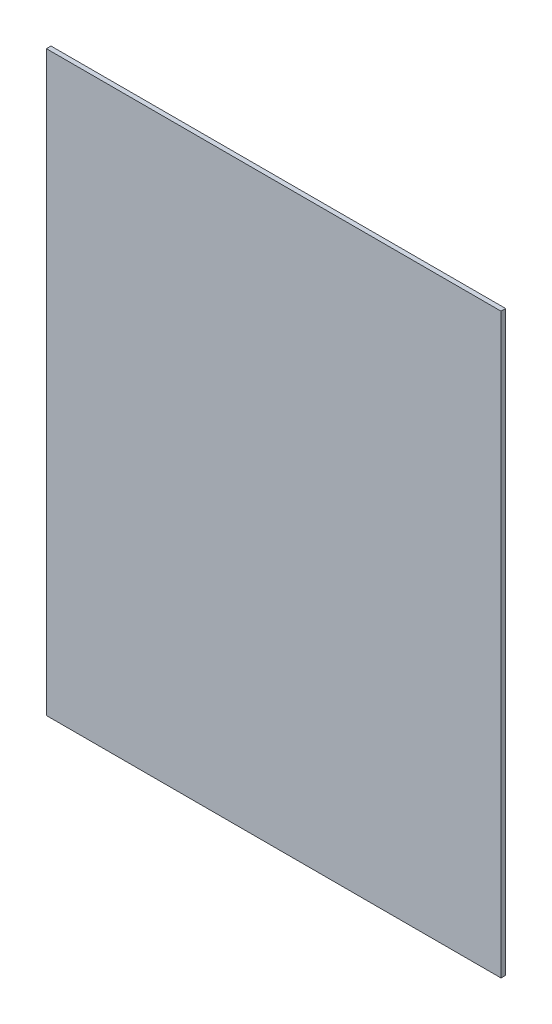
ISO-10303-21;
HEADER;
FILE_DESCRIPTION(('STEP AP214'),'2;1');
FILE_NAME('part.step','',(''),(''),'','','');
FILE_SCHEMA(('AUTOMOTIVE_DESIGN { 1 0 10303 214 1 1 1 1 }'));
ENDSEC;
DATA;
#1=APPLICATION_CONTEXT('core data for automotive mechanical design processes');
#2=APPLICATION_PROTOCOL_DEFINITION('international standard','automotive_design',2000,#1);
#3=PRODUCT_CONTEXT('',#1,'mechanical');
#4=PRODUCT('Part','Part','',(#3));
#5=PRODUCT_RELATED_PRODUCT_CATEGORY('part','',(#4));
#6=PRODUCT_DEFINITION_FORMATION('','',#4);
#7=PRODUCT_DEFINITION_CONTEXT('part definition',#1,'design');
#8=PRODUCT_DEFINITION('design','',#6,#7);
#9=PRODUCT_DEFINITION_SHAPE('','',#8);
#10=(LENGTH_UNIT() NAMED_UNIT(*) SI_UNIT(.MILLI.,.METRE.));
#11=(NAMED_UNIT(*) PLANE_ANGLE_UNIT() SI_UNIT($,.RADIAN.));
#12=(NAMED_UNIT(*) SI_UNIT($,.STERADIAN.) SOLID_ANGLE_UNIT());
#13=UNCERTAINTY_MEASURE_WITH_UNIT(LENGTH_MEASURE(1.E-05),#10,'distance_accuracy_value','');
#14=(GEOMETRIC_REPRESENTATION_CONTEXT(3) GLOBAL_UNCERTAINTY_ASSIGNED_CONTEXT((#13)) GLOBAL_UNIT_ASSIGNED_CONTEXT((#10,
#11,#12)) REPRESENTATION_CONTEXT('',''));
#15=CARTESIAN_POINT('',(0.,0.,0.));
#16=DIRECTION('',(0.,0.,1.));
#17=DIRECTION('',(1.,0.,0.));
#18=AXIS2_PLACEMENT_3D('',#15,#16,#17);
#19=CARTESIAN_POINT('',(36.9999999999999,5.50000000000002,0.75));
#20=DIRECTION('',(0.,1.,0.));
#21=DIRECTION('',(0.,0.,1.));
#22=AXIS2_PLACEMENT_3D('',#19,#20,#21);
#23=PLANE('',#22);
#24=DIRECTION('',(1.,0.,0.));
#25=VECTOR('',#24,1.);
#26=CARTESIAN_POINT('',(36.9999999999999,5.50000000000002,0.));
#27=LINE('',#26,#25);
#28=CARTESIAN_POINT('',(-37.,5.50000000000002,0.));
#29=VERTEX_POINT('',#28);
#30=CARTESIAN_POINT('',(36.9999999999999,5.50000000000002,0.));
#31=VERTEX_POINT('',#30);
#32=EDGE_CURVE('E96',#29,#31,#27,.T.);
#33=ORIENTED_EDGE('',*,*,#32,.T.);
#34=DIRECTION('',(0.,0.,-1.));
#35=VECTOR('',#34,1.);
#36=CARTESIAN_POINT('',(36.9999999999999,5.50000000000002,0.75));
#37=LINE('',#36,#35);
#38=CARTESIAN_POINT('',(36.9999999999999,5.50000000000002,0.75));
#39=VERTEX_POINT('',#38);
#40=EDGE_CURVE('E11',#39,#31,#37,.T.);
#41=ORIENTED_EDGE('',*,*,#40,.F.);
#42=DIRECTION('',(1.,0.,0.));
#43=VECTOR('',#42,1.);
#44=CARTESIAN_POINT('',(36.9999999999999,5.50000000000002,0.75));
#45=LINE('',#44,#43);
#46=CARTESIAN_POINT('',(-37.,5.50000000000002,0.75));
#47=VERTEX_POINT('',#46);
#48=EDGE_CURVE('E84',#47,#39,#45,.T.);
#49=ORIENTED_EDGE('',*,*,#48,.F.);
#50=DIRECTION('',(0.,0.,-1.));
#51=VECTOR('',#50,1.);
#52=CARTESIAN_POINT('',(-37.,5.50000000000002,0.75));
#53=LINE('',#52,#51);
#54=EDGE_CURVE('E92',#47,#29,#53,.T.);
#55=ORIENTED_EDGE('',*,*,#54,.T.);
#56=EDGE_LOOP('',(#33,#41,#49,#55));
#57=FACE_BOUND('',#56,.T.);
#58=ADVANCED_FACE('F33',(#57),#23,.F.);
#59=CARTESIAN_POINT('',(36.9999999999999,99.5,0.75));
#60=DIRECTION('',(-1.,0.,0.));
#61=DIRECTION('',(0.,0.,1.));
#62=AXIS2_PLACEMENT_3D('',#59,#60,#61);
#63=PLANE('',#62);
#64=DIRECTION('',(0.,1.,0.));
#65=VECTOR('',#64,1.);
#66=CARTESIAN_POINT('',(36.9999999999999,99.5,0.));
#67=LINE('',#66,#65);
#68=CARTESIAN_POINT('',(36.9999999999999,99.5,0.));
#69=VERTEX_POINT('',#68);
#70=EDGE_CURVE('E88',#31,#69,#67,.T.);
#71=ORIENTED_EDGE('',*,*,#70,.T.);
#72=DIRECTION('',(0.,0.,-1.));
#73=VECTOR('',#72,1.);
#74=CARTESIAN_POINT('',(36.9999999999999,99.5,0.75));
#75=LINE('',#74,#73);
#76=CARTESIAN_POINT('',(36.9999999999999,99.5,0.75));
#77=VERTEX_POINT('',#76);
#78=EDGE_CURVE('E41',#77,#69,#75,.T.);
#79=ORIENTED_EDGE('',*,*,#78,.F.);
#80=DIRECTION('',(0.,1.,0.));
#81=VECTOR('',#80,1.);
#82=CARTESIAN_POINT('',(36.9999999999999,99.5,0.75));
#83=LINE('',#82,#81);
#84=EDGE_CURVE('E79',#39,#77,#83,.T.);
#85=ORIENTED_EDGE('',*,*,#84,.F.);
#86=ORIENTED_EDGE('',*,*,#40,.T.);
#87=EDGE_LOOP('',(#71,#79,#85,#86));
#88=FACE_BOUND('',#87,.T.);
#89=ADVANCED_FACE('F87',(#88),#63,.F.);
#90=CARTESIAN_POINT('',(-37.,99.5,0.75));
#91=DIRECTION('',(0.,-1.,0.));
#92=DIRECTION('',(0.,0.,-1.));
#93=AXIS2_PLACEMENT_3D('',#90,#91,#92);
#94=PLANE('',#93);
#95=DIRECTION('',(-1.,0.,0.));
#96=VECTOR('',#95,1.);
#97=CARTESIAN_POINT('',(-37.,99.5,0.));
#98=LINE('',#97,#96);
#99=CARTESIAN_POINT('',(-37.,99.5,0.));
#100=VERTEX_POINT('',#99);
#101=EDGE_CURVE('E66',#69,#100,#98,.T.);
#102=ORIENTED_EDGE('',*,*,#101,.T.);
#103=DIRECTION('',(0.,0.,-1.));
#104=VECTOR('',#103,1.);
#105=CARTESIAN_POINT('',(-37.,99.5,0.75));
#106=LINE('',#105,#104);
#107=CARTESIAN_POINT('',(-37.,99.5,0.75));
#108=VERTEX_POINT('',#107);
#109=EDGE_CURVE('E89',#108,#100,#106,.T.);
#110=ORIENTED_EDGE('',*,*,#109,.F.);
#111=DIRECTION('',(-1.,0.,0.));
#112=VECTOR('',#111,1.);
#113=CARTESIAN_POINT('',(-37.,99.5,0.75));
#114=LINE('',#113,#112);
#115=EDGE_CURVE('E82',#77,#108,#114,.T.);
#116=ORIENTED_EDGE('',*,*,#115,.F.);
#117=ORIENTED_EDGE('',*,*,#78,.T.);
#118=EDGE_LOOP('',(#102,#110,#116,#117));
#119=FACE_BOUND('',#118,.T.);
#120=ADVANCED_FACE('F90',(#119),#94,.F.);
#121=CARTESIAN_POINT('',(-37.,5.50000000000002,0.75));
#122=DIRECTION('',(1.,0.,0.));
#123=DIRECTION('',(0.,0.,-1.));
#124=AXIS2_PLACEMENT_3D('',#121,#122,#123);
#125=PLANE('',#124);
#126=DIRECTION('',(0.,-1.,0.));
#127=VECTOR('',#126,1.);
#128=CARTESIAN_POINT('',(-37.,5.50000000000002,0.));
#129=LINE('',#128,#127);
#130=EDGE_CURVE('E72',#100,#29,#129,.T.);
#131=ORIENTED_EDGE('',*,*,#130,.T.);
#132=ORIENTED_EDGE('',*,*,#54,.F.);
#133=DIRECTION('',(0.,-1.,0.));
#134=VECTOR('',#133,1.);
#135=CARTESIAN_POINT('',(-37.,5.50000000000002,0.75));
#136=LINE('',#135,#134);
#137=EDGE_CURVE('E49',#108,#47,#136,.T.);
#138=ORIENTED_EDGE('',*,*,#137,.F.);
#139=ORIENTED_EDGE('',*,*,#109,.T.);
#140=EDGE_LOOP('',(#131,#132,#138,#139));
#141=FACE_BOUND('',#140,.T.);
#142=ADVANCED_FACE('F103',(#141),#125,.F.);
#143=CARTESIAN_POINT('',(0.,0.,0.75));
#144=DIRECTION('',(0.,0.,-1.));
#145=DIRECTION('',(-1.,0.,0.));
#146=AXIS2_PLACEMENT_3D('',#143,#144,#145);
#147=PLANE('',#146);
#148=ORIENTED_EDGE('',*,*,#48,.T.);
#149=ORIENTED_EDGE('',*,*,#84,.T.);
#150=ORIENTED_EDGE('',*,*,#115,.T.);
#151=ORIENTED_EDGE('',*,*,#137,.T.);
#152=EDGE_LOOP('',(#148,#149,#150,#151));
#153=FACE_BOUND('',#152,.T.);
#154=ADVANCED_FACE('F80',(#153),#147,.F.);
#155=CARTESIAN_POINT('',(0.,0.,0.));
#156=DIRECTION('',(0.,0.,-1.));
#157=DIRECTION('',(-1.,0.,0.));
#158=AXIS2_PLACEMENT_3D('',#155,#156,#157);
#159=PLANE('',#158);
#160=ORIENTED_EDGE('',*,*,#32,.F.);
#161=ORIENTED_EDGE('',*,*,#130,.F.);
#162=ORIENTED_EDGE('',*,*,#101,.F.);
#163=ORIENTED_EDGE('',*,*,#70,.F.);
#164=EDGE_LOOP('',(#160,#161,#162,#163));
#165=FACE_BOUND('',#164,.T.);
#166=ADVANCED_FACE('F106',(#165),#159,.T.);
#167=CLOSED_SHELL('',(#58,#89,#120,#142,#154,#166));
#168=MANIFOLD_SOLID_BREP('B2',#167);
#169=ADVANCED_BREP_SHAPE_REPRESENTATION('',(#18,#168),#14);
#170=SHAPE_DEFINITION_REPRESENTATION(#9,#169);
ENDSEC;
END-ISO-10303-21;
